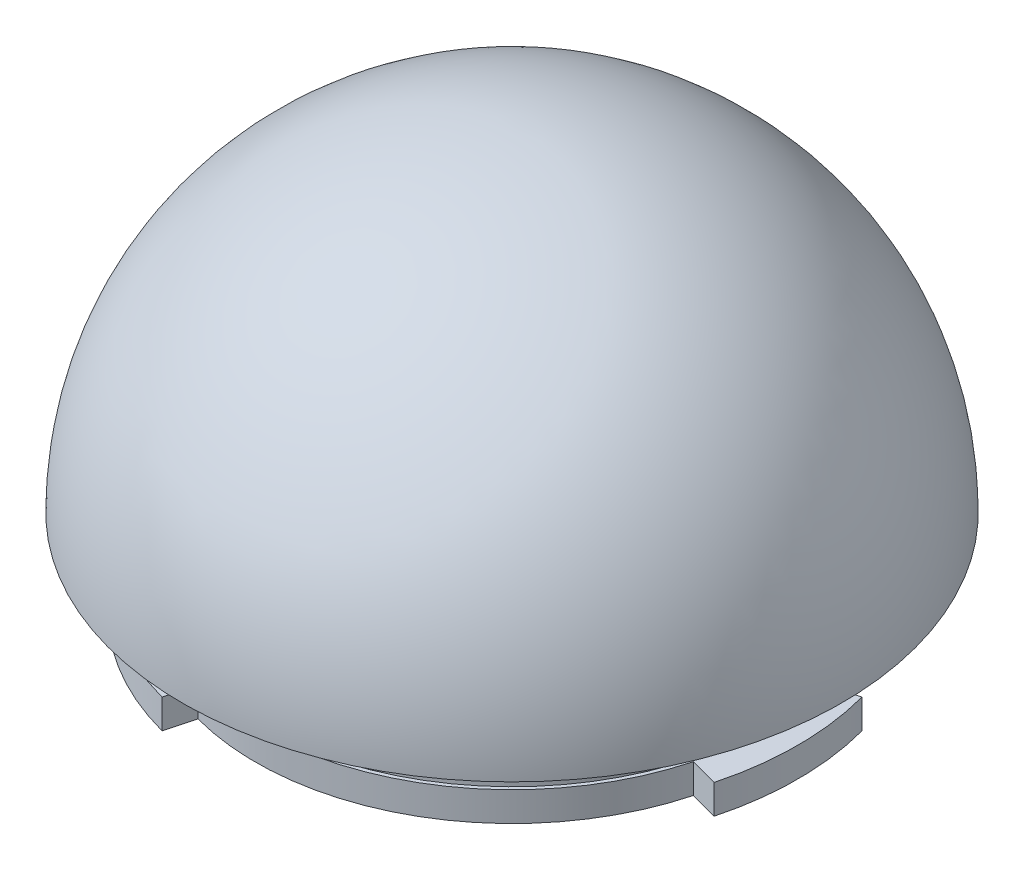
ISO-10303-21;
HEADER;
FILE_DESCRIPTION(('STEP AP214'),'2;1');
FILE_NAME('part.step','',(''),(''),'','','');
FILE_SCHEMA(('AUTOMOTIVE_DESIGN { 1 0 10303 214 1 1 1 1 }'));
ENDSEC;
DATA;
#1=APPLICATION_CONTEXT('core data for automotive mechanical design processes');
#2=APPLICATION_PROTOCOL_DEFINITION('international standard','automotive_design',2000,#1);
#3=PRODUCT_CONTEXT('',#1,'mechanical');
#4=PRODUCT('Part','Part','',(#3));
#5=PRODUCT_RELATED_PRODUCT_CATEGORY('part','',(#4));
#6=PRODUCT_DEFINITION_FORMATION('','',#4);
#7=PRODUCT_DEFINITION_CONTEXT('part definition',#1,'design');
#8=PRODUCT_DEFINITION('design','',#6,#7);
#9=PRODUCT_DEFINITION_SHAPE('','',#8);
#10=(LENGTH_UNIT() NAMED_UNIT(*) SI_UNIT(.MILLI.,.METRE.));
#11=(NAMED_UNIT(*) PLANE_ANGLE_UNIT() SI_UNIT($,.RADIAN.));
#12=(NAMED_UNIT(*) SI_UNIT($,.STERADIAN.) SOLID_ANGLE_UNIT());
#13=UNCERTAINTY_MEASURE_WITH_UNIT(LENGTH_MEASURE(1.E-05),#10,'distance_accuracy_value','');
#14=(GEOMETRIC_REPRESENTATION_CONTEXT(3) GLOBAL_UNCERTAINTY_ASSIGNED_CONTEXT((#13)) GLOBAL_UNIT_ASSIGNED_CONTEXT((#10,
#11,#12)) REPRESENTATION_CONTEXT('',''));
#15=CARTESIAN_POINT('',(0.,0.,0.));
#16=DIRECTION('',(0.,0.,1.));
#17=DIRECTION('',(1.,0.,0.));
#18=AXIS2_PLACEMENT_3D('',#15,#16,#17);
#19=CARTESIAN_POINT('',(0.,-8.,0.));
#20=DIRECTION('',(0.,-1.,0.));
#21=DIRECTION('',(1.,0.,0.));
#22=AXIS2_PLACEMENT_3D('',#19,#20,#21);
#23=CYLINDRICAL_SURFACE('',#22,39.);
#24=CARTESIAN_POINT('',(0.,-8.,0.));
#25=DIRECTION('',(0.,-1.,0.));
#26=DIRECTION('',(1.,0.,0.));
#27=AXIS2_PLACEMENT_3D('',#24,#25,#26);
#28=CIRCLE('',#27,39.);
#29=CARTESIAN_POINT('',(-10.0939427589983,-7.99999999999973,37.6711072252737));
#30=VERTEX_POINT('',#29);
#31=CARTESIAN_POINT('',(-27.5771644662754,-8.00000000000018,27.5771644662753));
#32=VERTEX_POINT('',#31);
#33=EDGE_CURVE('E162',#30,#32,#28,.T.);
#34=ORIENTED_EDGE('',*,*,#33,.T.);
#35=DIRECTION('',(0.,-1.,0.));
#36=VECTOR('',#35,1.);
#37=CARTESIAN_POINT('',(-27.5771644662754,-2.00000000000019,27.5771644662753));
#38=LINE('',#37,#36);
#39=CARTESIAN_POINT('',(-27.5771644662753,-12.0000000000002,27.5771644662753));
#40=VERTEX_POINT('',#39);
#41=EDGE_CURVE('E324',#32,#40,#38,.T.);
#42=ORIENTED_EDGE('',*,*,#41,.T.);
#43=CARTESIAN_POINT('',(0.,-12.,0.));
#44=DIRECTION('',(0.,-1.,0.));
#45=DIRECTION('',(1.,0.,0.));
#46=AXIS2_PLACEMENT_3D('',#43,#44,#45);
#47=CIRCLE('',#46,39.);
#48=CARTESIAN_POINT('',(-10.0939427589982,-12.0000000000001,37.6711072252737));
#49=VERTEX_POINT('',#48);
#50=EDGE_CURVE('E149',#49,#40,#47,.T.);
#51=ORIENTED_EDGE('',*,*,#50,.F.);
#52=DIRECTION('',(0.,-1.,0.));
#53=VECTOR('',#52,1.);
#54=CARTESIAN_POINT('',(-10.0939427589983,-2.00000000000006,37.6711072252737));
#55=LINE('',#54,#53);
#56=EDGE_CURVE('E242',#30,#49,#55,.T.);
#57=ORIENTED_EDGE('',*,*,#56,.F.);
#58=EDGE_LOOP('',(#34,#42,#51,#57));
#59=FACE_BOUND('',#58,.T.);
#60=ADVANCED_FACE('F33',(#59),#23,.T.);
#61=DIRECTION('',(0.,-1.,0.));
#62=VECTOR('',#61,1.);
#63=CARTESIAN_POINT('',(37.6711072252738,-1.99999999999974,-10.093942758998));
#64=LINE('',#63,#62);
#65=CARTESIAN_POINT('',(37.6711072252738,-7.99999999999973,-10.093942758998));
#66=VERTEX_POINT('',#65);
#67=CARTESIAN_POINT('',(37.6711072252738,-11.9999999999997,-10.093942758998));
#68=VERTEX_POINT('',#67);
#69=EDGE_CURVE('E142',#66,#68,#64,.T.);
#70=ORIENTED_EDGE('',*,*,#69,.F.);
#71=CARTESIAN_POINT('',(37.6711072252738,-7.99999999999975,10.0939427589981));
#72=VERTEX_POINT('',#71);
#73=EDGE_CURVE('E153',#66,#72,#28,.T.);
#74=ORIENTED_EDGE('',*,*,#73,.T.);
#75=DIRECTION('',(0.,-1.,0.));
#76=VECTOR('',#75,1.);
#77=CARTESIAN_POINT('',(37.6711072252737,-1.99999999999973,10.0939427589981));
#78=LINE('',#77,#76);
#79=CARTESIAN_POINT('',(37.6711072252738,-11.9999999999997,10.0939427589981));
#80=VERTEX_POINT('',#79);
#81=EDGE_CURVE('E227',#72,#80,#78,.T.);
#82=ORIENTED_EDGE('',*,*,#81,.T.);
#83=EDGE_CURVE('E150',#68,#80,#47,.T.);
#84=ORIENTED_EDGE('',*,*,#83,.F.);
#85=EDGE_LOOP('',(#70,#74,#82,#84));
#86=FACE_BOUND('',#85,.T.);
#87=ADVANCED_FACE('F181',(#86),#23,.T.);
#88=CARTESIAN_POINT('',(0.,7.,0.));
#89=DIRECTION('',(0.,-1.,0.));
#90=DIRECTION('',(1.,0.,0.));
#91=AXIS2_PLACEMENT_3D('',#88,#89,#90);
#92=PLANE('',#91);
#93=CARTESIAN_POINT('',(0.,7.,0.));
#94=DIRECTION('',(0.,-1.,0.));
#95=DIRECTION('',(1.,0.,0.));
#96=AXIS2_PLACEMENT_3D('',#93,#94,#95);
#97=CIRCLE('',#96,30.);
#98=CARTESIAN_POINT('',(30.,7.00000000000021,0.));
#99=VERTEX_POINT('',#98);
#100=EDGE_CURVE('E37',#99,#99,#97,.T.);
#101=ORIENTED_EDGE('',*,*,#100,.T.);
#102=EDGE_LOOP('',(#101));
#103=FACE_BOUND('',#102,.T.);
#104=CARTESIAN_POINT('',(0.,7.,0.));
#105=DIRECTION('',(0.,-1.,0.));
#106=DIRECTION('',(1.,0.,0.));
#107=AXIS2_PLACEMENT_3D('',#104,#105,#106);
#108=CIRCLE('',#107,39.3827373350304);
#109=CARTESIAN_POINT('',(39.3827373350304,7.00000000000028,0.));
#110=VERTEX_POINT('',#109);
#111=EDGE_CURVE('E42',#110,#110,#108,.F.);
#112=ORIENTED_EDGE('',*,*,#111,.T.);
#113=EDGE_LOOP('',(#112));
#114=FACE_BOUND('',#113,.T.);
#115=ADVANCED_FACE('F168',(#103,#114),#92,.F.);
#116=CARTESIAN_POINT('',(0.,0.,0.));
#117=DIRECTION('',(0.999613841431887,0.,0.0277879113606428));
#118=DIRECTION('',(-0.0277879113606428,0.,0.999613841431887));
#119=AXIS2_PLACEMENT_3D('',#116,#117,#118);
#120=SPHERICAL_SURFACE('',#119,40.);
#121=CARTESIAN_POINT('',(0.,0.,0.));
#122=DIRECTION('',(0.,-1.,0.));
#123=DIRECTION('',(1.,0.,0.));
#124=AXIS2_PLACEMENT_3D('',#121,#122,#123);
#125=SPHERICAL_SURFACE('',#124,40.);
#126=ORIENTED_EDGE('',*,*,#111,.F.);
#127=EDGE_LOOP('',(#126));
#128=FACE_BOUND('',#127,.T.);
#129=ADVANCED_FACE('F170',(#128),#125,.F.);
#130=CARTESIAN_POINT('',(0.,12.,0.));
#131=DIRECTION('',(0.,-1.,0.));
#132=DIRECTION('',(1.,0.,0.));
#133=AXIS2_PLACEMENT_3D('',#130,#131,#132);
#134=CYLINDRICAL_SURFACE('',#133,30.);
#135=CARTESIAN_POINT('',(0.,-12.,0.));
#136=DIRECTION('',(0.,-1.,0.));
#137=DIRECTION('',(1.,0.,0.));
#138=AXIS2_PLACEMENT_3D('',#135,#136,#137);
#139=CIRCLE('',#138,30.);
#140=CARTESIAN_POINT('',(30.0000000000001,-11.9999999999998,0.));
#141=VERTEX_POINT('',#140);
#142=EDGE_CURVE('E257',#141,#141,#139,.T.);
#143=ORIENTED_EDGE('',*,*,#142,.T.);
#144=EDGE_LOOP('',(#143));
#145=FACE_BOUND('',#144,.T.);
#146=ORIENTED_EDGE('',*,*,#100,.F.);
#147=EDGE_LOOP('',(#146));
#148=FACE_BOUND('',#147,.T.);
#149=ADVANCED_FACE('F172',(#145,#148),#134,.F.);
#150=CARTESIAN_POINT('',(0.,-12.,0.));
#151=DIRECTION('',(0.,1.,0.));
#152=DIRECTION('',(-1.,0.,0.));
#153=AXIS2_PLACEMENT_3D('',#150,#151,#152);
#154=CYLINDRICAL_SURFACE('',#153,34.5);
#155=CARTESIAN_POINT('',(0.,0.,0.));
#156=DIRECTION('',(0.,-1.,0.));
#157=DIRECTION('',(1.,0.,0.));
#158=AXIS2_PLACEMENT_3D('',#155,#156,#157);
#159=CIRCLE('',#158,34.5);
#160=CARTESIAN_POINT('',(34.5,2.40823587287632E-13,0.));
#161=VERTEX_POINT('',#160);
#162=EDGE_CURVE('E158',#161,#161,#159,.T.);
#163=ORIENTED_EDGE('',*,*,#162,.T.);
#164=EDGE_LOOP('',(#163));
#165=FACE_BOUND('',#164,.T.);
#166=CARTESIAN_POINT('',(0.,-8.,0.));
#167=DIRECTION('',(0.,-1.,0.));
#168=DIRECTION('',(1.,0.,0.));
#169=AXIS2_PLACEMENT_3D('',#166,#167,#168);
#170=CIRCLE('',#169,34.5);
#171=CARTESIAN_POINT('',(34.5,-7.99999999999976,0.));
#172=VERTEX_POINT('',#171);
#173=EDGE_CURVE('E11',#172,#172,#170,.T.);
#174=ORIENTED_EDGE('',*,*,#173,.F.);
#175=EDGE_LOOP('',(#174));
#176=FACE_BOUND('',#175,.T.);
#177=ADVANCED_FACE('F178',(#165,#176),#154,.T.);
#178=CARTESIAN_POINT('',(0.,0.,0.));
#179=DIRECTION('',(0.0271221426448348,0.,-0.999632127023913));
#180=DIRECTION('',(-0.999632127023913,0.,-0.0271221426448348));
#181=AXIS2_PLACEMENT_3D('',#178,#179,#180);
#182=SPHERICAL_SURFACE('',#181,45.);
#183=CARTESIAN_POINT('',(0.,0.,0.));
#184=DIRECTION('',(0.,-1.,0.));
#185=DIRECTION('',(-0.0542243302830044,0.,0.998528778756707));
#186=AXIS2_PLACEMENT_3D('',#183,#184,#185);
#187=SPHERICAL_SURFACE('',#186,45.);
#188=CARTESIAN_POINT('',(0.,0.,0.));
#189=DIRECTION('',(0.,-1.,0.));
#190=DIRECTION('',(-0.0542243302830044,0.,0.998528778756707));
#191=AXIS2_PLACEMENT_3D('',#188,#189,#190);
#192=CIRCLE('',#191,45.);
#193=CARTESIAN_POINT('',(-2.4400948627352,0.,44.9337950440518));
#194=VERTEX_POINT('',#193);
#195=EDGE_CURVE('E161',#194,#194,#192,.T.);
#196=ORIENTED_EDGE('',*,*,#195,.F.);
#197=EDGE_LOOP('',(#196));
#198=FACE_BOUND('',#197,.T.);
#199=ADVANCED_FACE('F35',(#198),#187,.T.);
#200=CARTESIAN_POINT('',(0.,0.,0.));
#201=DIRECTION('',(0.,-1.,0.));
#202=DIRECTION('',(-0.0542243302830044,0.,0.998528778756707));
#203=AXIS2_PLACEMENT_3D('',#200,#201,#202);
#204=PLANE('',#203);
#205=ORIENTED_EDGE('',*,*,#162,.F.);
#206=EDGE_LOOP('',(#205));
#207=FACE_BOUND('',#206,.T.);
#208=ORIENTED_EDGE('',*,*,#195,.T.);
#209=EDGE_LOOP('',(#208));
#210=FACE_BOUND('',#209,.T.);
#211=ADVANCED_FACE('F197',(#207,#210),#204,.T.);
#212=DIRECTION('',(0.,-1.,0.));
#213=VECTOR('',#212,1.);
#214=CARTESIAN_POINT('',(-27.5771644662754,-2.0000000000002,-27.5771644662753));
#215=LINE('',#214,#213);
#216=CARTESIAN_POINT('',(-27.5771644662753,-7.99999999999973,-27.5771644662753));
#217=VERTEX_POINT('',#216);
#218=CARTESIAN_POINT('',(-27.5771644662753,-12.0000000000002,-27.5771644662753));
#219=VERTEX_POINT('',#218);
#220=EDGE_CURVE('E322',#217,#219,#215,.T.);
#221=ORIENTED_EDGE('',*,*,#220,.F.);
#222=CARTESIAN_POINT('',(-10.0939427589985,-8.00000000000007,-37.6711072252736));
#223=VERTEX_POINT('',#222);
#224=EDGE_CURVE('E141',#217,#223,#28,.T.);
#225=ORIENTED_EDGE('',*,*,#224,.T.);
#226=DIRECTION('',(0.,-1.,0.));
#227=VECTOR('',#226,1.);
#228=CARTESIAN_POINT('',(-10.0939427589985,-2.00000000000008,-37.6711072252736));
#229=LINE('',#228,#227);
#230=CARTESIAN_POINT('',(-10.0939427589985,-12.0000000000001,-37.6711072252736));
#231=VERTEX_POINT('',#230);
#232=EDGE_CURVE('E127',#223,#231,#229,.T.);
#233=ORIENTED_EDGE('',*,*,#232,.T.);
#234=EDGE_CURVE('E139',#219,#231,#47,.T.);
#235=ORIENTED_EDGE('',*,*,#234,.F.);
#236=EDGE_LOOP('',(#221,#225,#233,#235));
#237=FACE_BOUND('',#236,.T.);
#238=ADVANCED_FACE('F138',(#237),#23,.T.);
#239=CARTESIAN_POINT('',(0.,-8.,0.));
#240=DIRECTION('',(0.,-1.,0.));
#241=DIRECTION('',(1.,0.,0.));
#242=AXIS2_PLACEMENT_3D('',#239,#240,#241);
#243=PLANE('',#242);
#244=ORIENTED_EDGE('',*,*,#173,.T.);
#245=EDGE_LOOP('',(#244));
#246=FACE_BOUND('',#245,.T.);
#247=ORIENTED_EDGE('',*,*,#224,.F.);
#248=DIRECTION('',(0.707106781186548,0.,0.707106781186547));
#249=VECTOR('',#248,1.);
#250=CARTESIAN_POINT('',(0.,-8.,0.));
#251=LINE('',#250,#249);
#252=CARTESIAN_POINT('',(-24.7487373415291,-8.00000000000019,-24.7487373415292));
#253=VERTEX_POINT('',#252);
#254=EDGE_CURVE('E219',#217,#253,#251,.T.);
#255=ORIENTED_EDGE('',*,*,#254,.T.);
#256=CARTESIAN_POINT('',(0.,-8.,0.));
#257=DIRECTION('',(0.,-1.,0.));
#258=DIRECTION('',(1.,0.,0.));
#259=AXIS2_PLACEMENT_3D('',#256,#257,#258);
#260=CIRCLE('',#259,35.);
#261=CARTESIAN_POINT('',(-24.7487373415292,-8.00000000000018,24.7487373415291));
#262=VERTEX_POINT('',#261);
#263=EDGE_CURVE('E256',#262,#253,#260,.T.);
#264=ORIENTED_EDGE('',*,*,#263,.F.);
#265=DIRECTION('',(0.707106781186549,0.,-0.707106781186546));
#266=VECTOR('',#265,1.);
#267=CARTESIAN_POINT('',(0.,-8.,0.));
#268=LINE('',#267,#266);
#269=EDGE_CURVE('E253',#32,#262,#268,.T.);
#270=ORIENTED_EDGE('',*,*,#269,.F.);
#271=ORIENTED_EDGE('',*,*,#33,.F.);
#272=DIRECTION('',(0.258819045102521,0.,-0.965925826289068));
#273=VECTOR('',#272,1.);
#274=CARTESIAN_POINT('',(0.,-8.,0.));
#275=LINE('',#274,#273);
#276=CARTESIAN_POINT('',(-9.05866657858818,-8.00000000000006,33.8074039201174));
#277=VERTEX_POINT('',#276);
#278=EDGE_CURVE('E238',#30,#277,#275,.T.);
#279=ORIENTED_EDGE('',*,*,#278,.T.);
#280=CARTESIAN_POINT('',(0.,-8.,0.));
#281=DIRECTION('',(0.,-1.,0.));
#282=DIRECTION('',(1.,0.,0.));
#283=AXIS2_PLACEMENT_3D('',#280,#281,#282);
#284=CIRCLE('',#283,35.);
#285=CARTESIAN_POINT('',(33.8074039201175,-7.99999999999975,9.05866657858805));
#286=VERTEX_POINT('',#285);
#287=EDGE_CURVE('E234',#286,#277,#284,.T.);
#288=ORIENTED_EDGE('',*,*,#287,.F.);
#289=DIRECTION('',(-0.96592582628907,0.,-0.258819045102516));
#290=VECTOR('',#289,1.);
#291=CARTESIAN_POINT('',(0.,-8.,0.));
#292=LINE('',#291,#290);
#293=EDGE_CURVE('E232',#72,#286,#292,.T.);
#294=ORIENTED_EDGE('',*,*,#293,.F.);
#295=ORIENTED_EDGE('',*,*,#73,.F.);
#296=DIRECTION('',(-0.96592582628907,0.,0.258819045102514));
#297=VECTOR('',#296,1.);
#298=CARTESIAN_POINT('',(0.,-8.,0.));
#299=LINE('',#298,#297);
#300=CARTESIAN_POINT('',(33.8074039201175,-7.99999999999975,-9.05866657858798));
#301=VERTEX_POINT('',#300);
#302=EDGE_CURVE('E230',#66,#301,#299,.T.);
#303=ORIENTED_EDGE('',*,*,#302,.T.);
#304=CARTESIAN_POINT('',(0.,-8.,0.));
#305=DIRECTION('',(0.,-1.,0.));
#306=DIRECTION('',(1.,0.,0.));
#307=AXIS2_PLACEMENT_3D('',#304,#305,#306);
#308=CIRCLE('',#307,35.);
#309=CARTESIAN_POINT('',(-9.05866657858837,-8.00000000000007,-33.8074039201173));
#310=VERTEX_POINT('',#309);
#311=EDGE_CURVE('E251',#310,#301,#308,.T.);
#312=ORIENTED_EDGE('',*,*,#311,.F.);
#313=DIRECTION('',(-0.258819045102527,0.,-0.965925826289067));
#314=VECTOR('',#313,1.);
#315=CARTESIAN_POINT('',(0.,-8.,0.));
#316=LINE('',#315,#314);
#317=EDGE_CURVE('E221',#310,#223,#316,.T.);
#318=ORIENTED_EDGE('',*,*,#317,.T.);
#319=EDGE_LOOP('',(#247,#255,#264,#270,#271,#279,#288,#294,#295,#303,#312,#318));
#320=FACE_BOUND('',#319,.T.);
#321=ADVANCED_FACE('F196',(#246,#320),#243,.F.);
#322=CARTESIAN_POINT('',(0.,-12.,0.));
#323=DIRECTION('',(0.,-1.,0.));
#324=DIRECTION('',(1.,0.,0.));
#325=AXIS2_PLACEMENT_3D('',#322,#323,#324);
#326=PLANE('',#325);
#327=DIRECTION('',(0.707106781186548,0.,0.707106781186547));
#328=VECTOR('',#327,1.);
#329=CARTESIAN_POINT('',(0.,-12.,0.));
#330=LINE('',#329,#328);
#331=CARTESIAN_POINT('',(-24.7487373415291,-12.0000000000002,-24.7487373415291));
#332=VERTEX_POINT('',#331);
#333=EDGE_CURVE('E148',#219,#332,#330,.T.);
#334=ORIENTED_EDGE('',*,*,#333,.F.);
#335=ORIENTED_EDGE('',*,*,#234,.T.);
#336=DIRECTION('',(-0.258819045102527,0.,-0.965925826289067));
#337=VECTOR('',#336,1.);
#338=CARTESIAN_POINT('',(0.,-12.,0.));
#339=LINE('',#338,#337);
#340=CARTESIAN_POINT('',(-9.05866657858834,-12.0000000000001,-33.8074039201173));
#341=VERTEX_POINT('',#340);
#342=EDGE_CURVE('E124',#341,#231,#339,.T.);
#343=ORIENTED_EDGE('',*,*,#342,.F.);
#344=CARTESIAN_POINT('',(0.,-12.,0.));
#345=DIRECTION('',(0.,-1.,0.));
#346=DIRECTION('',(1.,0.,0.));
#347=AXIS2_PLACEMENT_3D('',#344,#345,#346);
#348=CIRCLE('',#347,35.);
#349=CARTESIAN_POINT('',(33.8074039201175,-11.9999999999998,-9.05866657858798));
#350=VERTEX_POINT('',#349);
#351=EDGE_CURVE('E57',#341,#350,#348,.T.);
#352=ORIENTED_EDGE('',*,*,#351,.T.);
#353=DIRECTION('',(-0.96592582628907,0.,0.258819045102514));
#354=VECTOR('',#353,1.);
#355=CARTESIAN_POINT('',(0.,-12.,0.));
#356=LINE('',#355,#354);
#357=EDGE_CURVE('E132',#68,#350,#356,.T.);
#358=ORIENTED_EDGE('',*,*,#357,.F.);
#359=ORIENTED_EDGE('',*,*,#83,.T.);
#360=DIRECTION('',(-0.96592582628907,0.,-0.258819045102516));
#361=VECTOR('',#360,1.);
#362=CARTESIAN_POINT('',(0.,-12.,0.));
#363=LINE('',#362,#361);
#364=CARTESIAN_POINT('',(33.8074039201175,-11.9999999999998,9.05866657858803));
#365=VERTEX_POINT('',#364);
#366=EDGE_CURVE('E330',#80,#365,#363,.T.);
#367=ORIENTED_EDGE('',*,*,#366,.T.);
#368=CARTESIAN_POINT('',(0.,-12.,0.));
#369=DIRECTION('',(0.,-1.,0.));
#370=DIRECTION('',(1.,0.,0.));
#371=AXIS2_PLACEMENT_3D('',#368,#369,#370);
#372=CIRCLE('',#371,35.);
#373=CARTESIAN_POINT('',(-9.05866657858816,-12.0000000000001,33.8074039201174));
#374=VERTEX_POINT('',#373);
#375=EDGE_CURVE('E312',#365,#374,#372,.T.);
#376=ORIENTED_EDGE('',*,*,#375,.T.);
#377=DIRECTION('',(0.258819045102521,0.,-0.965925826289068));
#378=VECTOR('',#377,1.);
#379=CARTESIAN_POINT('',(0.,-12.,0.));
#380=LINE('',#379,#378);
#381=EDGE_CURVE('E332',#49,#374,#380,.T.);
#382=ORIENTED_EDGE('',*,*,#381,.F.);
#383=ORIENTED_EDGE('',*,*,#50,.T.);
#384=DIRECTION('',(0.707106781186549,0.,-0.707106781186546));
#385=VECTOR('',#384,1.);
#386=CARTESIAN_POINT('',(0.,-12.,0.));
#387=LINE('',#386,#385);
#388=CARTESIAN_POINT('',(-24.7487373415292,-12.0000000000002,24.7487373415291));
#389=VERTEX_POINT('',#388);
#390=EDGE_CURVE('E315',#40,#389,#387,.T.);
#391=ORIENTED_EDGE('',*,*,#390,.T.);
#392=CARTESIAN_POINT('',(0.,-12.,0.));
#393=DIRECTION('',(0.,-1.,0.));
#394=DIRECTION('',(1.,0.,0.));
#395=AXIS2_PLACEMENT_3D('',#392,#393,#394);
#396=CIRCLE('',#395,35.);
#397=EDGE_CURVE('E49',#389,#332,#396,.T.);
#398=ORIENTED_EDGE('',*,*,#397,.T.);
#399=EDGE_LOOP('',(#334,#335,#343,#352,#358,#359,#367,#376,#382,#383,#391,#398));
#400=FACE_BOUND('',#399,.T.);
#401=ORIENTED_EDGE('',*,*,#142,.F.);
#402=EDGE_LOOP('',(#401));
#403=FACE_BOUND('',#402,.T.);
#404=ADVANCED_FACE('F145',(#400,#403),#326,.T.);
#405=CARTESIAN_POINT('',(0.,-2.,0.));
#406=DIRECTION('',(0.,-1.,0.));
#407=DIRECTION('',(1.,0.,0.));
#408=AXIS2_PLACEMENT_3D('',#405,#406,#407);
#409=CYLINDRICAL_SURFACE('',#408,35.);
#410=ORIENTED_EDGE('',*,*,#287,.T.);
#411=DIRECTION('',(0.,-1.,0.));
#412=VECTOR('',#411,1.);
#413=CARTESIAN_POINT('',(-9.05866657858823,-2.00000000000006,33.8074039201174));
#414=LINE('',#413,#412);
#415=EDGE_CURVE('E239',#277,#374,#414,.T.);
#416=ORIENTED_EDGE('',*,*,#415,.T.);
#417=ORIENTED_EDGE('',*,*,#375,.F.);
#418=DIRECTION('',(0.,-1.,0.));
#419=VECTOR('',#418,1.);
#420=CARTESIAN_POINT('',(33.8074039201175,-1.99999999999976,9.05866657858804));
#421=LINE('',#420,#419);
#422=EDGE_CURVE('E245',#286,#365,#421,.T.);
#423=ORIENTED_EDGE('',*,*,#422,.F.);
#424=EDGE_LOOP('',(#410,#416,#417,#423));
#425=FACE_BOUND('',#424,.T.);
#426=ADVANCED_FACE('F264',(#425),#409,.T.);
#427=CARTESIAN_POINT('',(0.,-2.,0.));
#428=DIRECTION('',(-0.965925826289068,0.,-0.258819045102521));
#429=DIRECTION('',(-0.258819045102521,0.,0.965925826289068));
#430=AXIS2_PLACEMENT_3D('',#427,#428,#429);
#431=PLANE('',#430);
#432=ORIENTED_EDGE('',*,*,#56,.T.);
#433=ORIENTED_EDGE('',*,*,#381,.T.);
#434=ORIENTED_EDGE('',*,*,#415,.F.);
#435=ORIENTED_EDGE('',*,*,#278,.F.);
#436=EDGE_LOOP('',(#432,#433,#434,#435));
#437=FACE_BOUND('',#436,.T.);
#438=ADVANCED_FACE('F269',(#437),#431,.F.);
#439=CARTESIAN_POINT('',(0.,-2.,0.));
#440=DIRECTION('',(-0.258819045102516,0.,0.96592582628907));
#441=DIRECTION('',(0.96592582628907,0.,0.258819045102516));
#442=AXIS2_PLACEMENT_3D('',#439,#440,#441);
#443=PLANE('',#442);
#444=ORIENTED_EDGE('',*,*,#293,.T.);
#445=ORIENTED_EDGE('',*,*,#422,.T.);
#446=ORIENTED_EDGE('',*,*,#366,.F.);
#447=ORIENTED_EDGE('',*,*,#81,.F.);
#448=EDGE_LOOP('',(#444,#445,#446,#447));
#449=FACE_BOUND('',#448,.T.);
#450=ADVANCED_FACE('F275',(#449),#443,.T.);
#451=CARTESIAN_POINT('',(0.,-2.,0.));
#452=DIRECTION('',(0.,-1.,0.));
#453=DIRECTION('',(1.,0.,0.));
#454=AXIS2_PLACEMENT_3D('',#451,#452,#453);
#455=CYLINDRICAL_SURFACE('',#454,35.);
#456=ORIENTED_EDGE('',*,*,#311,.T.);
#457=DIRECTION('',(0.,-1.,0.));
#458=VECTOR('',#457,1.);
#459=CARTESIAN_POINT('',(33.8074039201175,-1.99999999999977,-9.05866657858798));
#460=LINE('',#459,#458);
#461=EDGE_CURVE('E305',#301,#350,#460,.T.);
#462=ORIENTED_EDGE('',*,*,#461,.T.);
#463=ORIENTED_EDGE('',*,*,#351,.F.);
#464=DIRECTION('',(0.,-1.,0.));
#465=VECTOR('',#464,1.);
#466=CARTESIAN_POINT('',(-9.05866657858841,-2.00000000000007,-33.8074039201173));
#467=LINE('',#466,#465);
#468=EDGE_CURVE('E129',#310,#341,#467,.T.);
#469=ORIENTED_EDGE('',*,*,#468,.F.);
#470=EDGE_LOOP('',(#456,#462,#463,#469));
#471=FACE_BOUND('',#470,.T.);
#472=ADVANCED_FACE('F280',(#471),#455,.T.);
#473=CARTESIAN_POINT('',(0.,-2.,0.));
#474=DIRECTION('',(0.258819045102514,0.,0.96592582628907));
#475=DIRECTION('',(0.96592582628907,0.,-0.258819045102514));
#476=AXIS2_PLACEMENT_3D('',#473,#474,#475);
#477=PLANE('',#476);
#478=ORIENTED_EDGE('',*,*,#69,.T.);
#479=ORIENTED_EDGE('',*,*,#357,.T.);
#480=ORIENTED_EDGE('',*,*,#461,.F.);
#481=ORIENTED_EDGE('',*,*,#302,.F.);
#482=EDGE_LOOP('',(#478,#479,#480,#481));
#483=FACE_BOUND('',#482,.T.);
#484=ADVANCED_FACE('F295',(#483),#477,.F.);
#485=CARTESIAN_POINT('',(0.,-2.,0.));
#486=DIRECTION('',(-0.965925826289067,0.,0.258819045102526));
#487=DIRECTION('',(0.258819045102527,0.,0.965925826289067));
#488=AXIS2_PLACEMENT_3D('',#485,#486,#487);
#489=PLANE('',#488);
#490=ORIENTED_EDGE('',*,*,#468,.T.);
#491=ORIENTED_EDGE('',*,*,#342,.T.);
#492=ORIENTED_EDGE('',*,*,#232,.F.);
#493=ORIENTED_EDGE('',*,*,#317,.F.);
#494=EDGE_LOOP('',(#490,#491,#492,#493));
#495=FACE_BOUND('',#494,.T.);
#496=ADVANCED_FACE('F126',(#495),#489,.F.);
#497=CARTESIAN_POINT('',(0.,-2.,0.));
#498=DIRECTION('',(0.,-1.,0.));
#499=DIRECTION('',(1.,0.,0.));
#500=AXIS2_PLACEMENT_3D('',#497,#498,#499);
#501=CYLINDRICAL_SURFACE('',#500,35.);
#502=ORIENTED_EDGE('',*,*,#263,.T.);
#503=DIRECTION('',(0.,-1.,0.));
#504=VECTOR('',#503,1.);
#505=CARTESIAN_POINT('',(-24.7487373415292,-2.00000000000018,-24.7487373415292));
#506=LINE('',#505,#504);
#507=EDGE_CURVE('E320',#253,#332,#506,.T.);
#508=ORIENTED_EDGE('',*,*,#507,.T.);
#509=ORIENTED_EDGE('',*,*,#397,.F.);
#510=DIRECTION('',(0.,-1.,0.));
#511=VECTOR('',#510,1.);
#512=CARTESIAN_POINT('',(-24.7487373415292,-2.00000000000017,24.7487373415291));
#513=LINE('',#512,#511);
#514=EDGE_CURVE('E319',#262,#389,#513,.T.);
#515=ORIENTED_EDGE('',*,*,#514,.F.);
#516=EDGE_LOOP('',(#502,#508,#509,#515));
#517=FACE_BOUND('',#516,.T.);
#518=ADVANCED_FACE('F282',(#517),#501,.T.);
#519=CARTESIAN_POINT('',(0.,-2.,0.));
#520=DIRECTION('',(0.707106781186547,0.,-0.707106781186548));
#521=DIRECTION('',(-0.707106781186548,0.,-0.707106781186547));
#522=AXIS2_PLACEMENT_3D('',#519,#520,#521);
#523=PLANE('',#522);
#524=ORIENTED_EDGE('',*,*,#220,.T.);
#525=ORIENTED_EDGE('',*,*,#333,.T.);
#526=ORIENTED_EDGE('',*,*,#507,.F.);
#527=ORIENTED_EDGE('',*,*,#254,.F.);
#528=EDGE_LOOP('',(#524,#525,#526,#527));
#529=FACE_BOUND('',#528,.T.);
#530=ADVANCED_FACE('F285',(#529),#523,.F.);
#531=CARTESIAN_POINT('',(0.,-2.,0.));
#532=DIRECTION('',(-0.707106781186546,0.,-0.707106781186549));
#533=DIRECTION('',(-0.707106781186549,0.,0.707106781186546));
#534=AXIS2_PLACEMENT_3D('',#531,#532,#533);
#535=PLANE('',#534);
#536=ORIENTED_EDGE('',*,*,#269,.T.);
#537=ORIENTED_EDGE('',*,*,#514,.T.);
#538=ORIENTED_EDGE('',*,*,#390,.F.);
#539=ORIENTED_EDGE('',*,*,#41,.F.);
#540=EDGE_LOOP('',(#536,#537,#538,#539));
#541=FACE_BOUND('',#540,.T.);
#542=ADVANCED_FACE('F286',(#541),#535,.T.);
#543=CLOSED_SHELL('',(#60,#87,#115,#129,#149,#177,#199,#211,#238,#321,#404,#426,#438,#450,#472,
#484,#496,#518,#530,#542));
#544=MANIFOLD_SOLID_BREP('B2',#543);
#545=ADVANCED_BREP_SHAPE_REPRESENTATION('',(#18,#544),#14);
#546=SHAPE_DEFINITION_REPRESENTATION(#9,#545);
ENDSEC;
END-ISO-10303-21;
